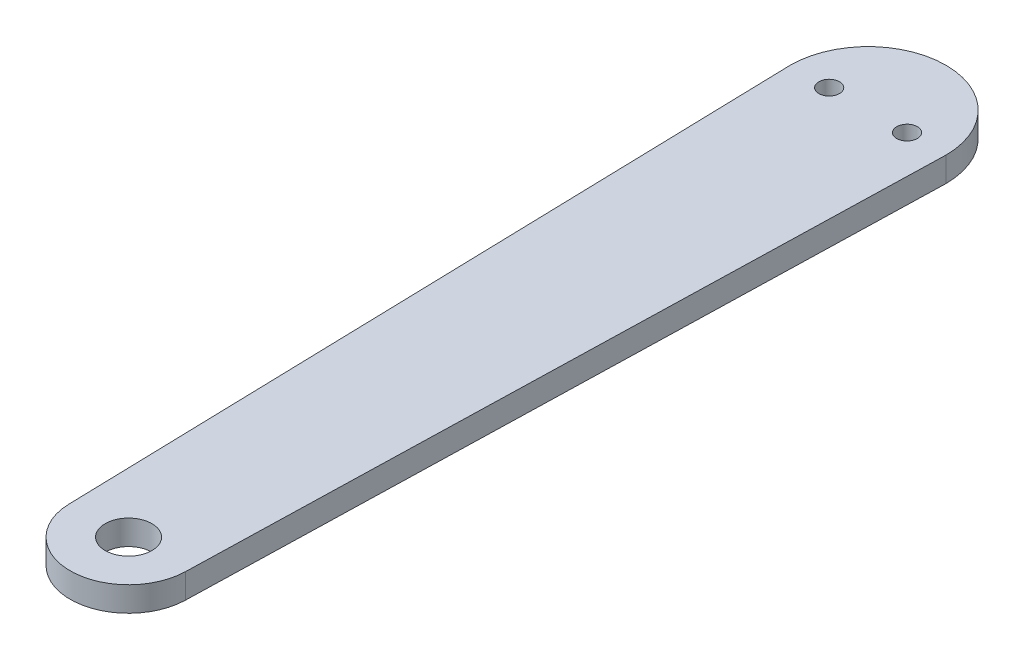
ISO-10303-21;
HEADER;
FILE_DESCRIPTION(('STEP AP214'),'2;1');
FILE_NAME('part.step','',(''),(''),'','','');
FILE_SCHEMA(('AUTOMOTIVE_DESIGN { 1 0 10303 214 1 1 1 1 }'));
ENDSEC;
DATA;
#1=APPLICATION_CONTEXT('core data for automotive mechanical design processes');
#2=APPLICATION_PROTOCOL_DEFINITION('international standard','automotive_design',2000,#1);
#3=PRODUCT_CONTEXT('',#1,'mechanical');
#4=PRODUCT('Part','Part','',(#3));
#5=PRODUCT_RELATED_PRODUCT_CATEGORY('part','',(#4));
#6=PRODUCT_DEFINITION_FORMATION('','',#4);
#7=PRODUCT_DEFINITION_CONTEXT('part definition',#1,'design');
#8=PRODUCT_DEFINITION('design','',#6,#7);
#9=PRODUCT_DEFINITION_SHAPE('','',#8);
#10=(LENGTH_UNIT() NAMED_UNIT(*) SI_UNIT(.MILLI.,.METRE.));
#11=(NAMED_UNIT(*) PLANE_ANGLE_UNIT() SI_UNIT($,.RADIAN.));
#12=(NAMED_UNIT(*) SI_UNIT($,.STERADIAN.) SOLID_ANGLE_UNIT());
#13=UNCERTAINTY_MEASURE_WITH_UNIT(LENGTH_MEASURE(1.E-05),#10,'distance_accuracy_value','');
#14=(GEOMETRIC_REPRESENTATION_CONTEXT(3) GLOBAL_UNCERTAINTY_ASSIGNED_CONTEXT((#13)) GLOBAL_UNIT_ASSIGNED_CONTEXT((#10,
#11,#12)) REPRESENTATION_CONTEXT('',''));
#15=CARTESIAN_POINT('',(0.,0.,0.));
#16=DIRECTION('',(0.,0.,1.));
#17=DIRECTION('',(1.,0.,0.));
#18=AXIS2_PLACEMENT_3D('',#15,#16,#17);
#19=CARTESIAN_POINT('',(0.,6.35,0.));
#20=DIRECTION('',(0.,-1.,0.));
#21=DIRECTION('',(0.,0.,-1.));
#22=AXIS2_PLACEMENT_3D('',#19,#20,#21);
#23=PLANE('',#22);
#24=CARTESIAN_POINT('',(-10.,6.35,0.));
#25=DIRECTION('',(0.,1.,0.));
#26=DIRECTION('',(0.,0.,1.));
#27=AXIS2_PLACEMENT_3D('',#24,#25,#26);
#28=CIRCLE('',#27,2.64999999999999);
#29=CARTESIAN_POINT('',(-10.,6.35,2.64999999999999));
#30=VERTEX_POINT('',#29);
#31=EDGE_CURVE('E130',#30,#30,#28,.T.);
#32=ORIENTED_EDGE('',*,*,#31,.F.);
#33=EDGE_LOOP('',(#32));
#34=FACE_BOUND('',#33,.T.);
#35=CARTESIAN_POINT('',(10.,6.35,0.));
#36=DIRECTION('',(0.,1.,0.));
#37=DIRECTION('',(0.,0.,1.));
#38=AXIS2_PLACEMENT_3D('',#35,#36,#37);
#39=CIRCLE('',#38,2.64999999999999);
#40=CARTESIAN_POINT('',(10.,6.35,2.64999999999999));
#41=VERTEX_POINT('',#40);
#42=EDGE_CURVE('E124',#41,#41,#39,.T.);
#43=ORIENTED_EDGE('',*,*,#42,.F.);
#44=EDGE_LOOP('',(#43));
#45=FACE_BOUND('',#44,.T.);
#46=CARTESIAN_POINT('',(0.,6.35,0.));
#47=DIRECTION('',(0.,1.,0.));
#48=DIRECTION('',(0.,0.,-1.));
#49=AXIS2_PLACEMENT_3D('',#46,#47,#48);
#50=CIRCLE('',#49,20.);
#51=CARTESIAN_POINT('',(20.,6.35,0.));
#52=VERTEX_POINT('',#51);
#53=CARTESIAN_POINT('',(-20.,6.35,0.));
#54=VERTEX_POINT('',#53);
#55=EDGE_CURVE('E89',#52,#54,#50,.T.);
#56=ORIENTED_EDGE('',*,*,#55,.T.);
#57=DIRECTION('',(0.0262794353684428,0.,0.999654636000212));
#58=VECTOR('',#57,1.);
#59=CARTESIAN_POINT('',(-20.,6.35,0.));
#60=LINE('',#59,#58);
#61=CARTESIAN_POINT('',(-14.9948195400033,6.35,190.394191530527));
#62=VERTEX_POINT('',#61);
#63=EDGE_CURVE('E84',#54,#62,#60,.T.);
#64=ORIENTED_EDGE('',*,*,#63,.T.);
#65=CARTESIAN_POINT('',(0.,6.35,190.));
#66=DIRECTION('',(0.,1.,0.));
#67=DIRECTION('',(0.,0.,1.));
#68=AXIS2_PLACEMENT_3D('',#65,#66,#67);
#69=CIRCLE('',#68,15.);
#70=CARTESIAN_POINT('',(14.9948195400031,6.35,190.394191530527));
#71=VERTEX_POINT('',#70);
#72=EDGE_CURVE('E87',#62,#71,#69,.T.);
#73=ORIENTED_EDGE('',*,*,#72,.T.);
#74=DIRECTION('',(0.0262794353684434,0.,-0.999654636000212));
#75=VECTOR('',#74,1.);
#76=CARTESIAN_POINT('',(20.,6.35,0.));
#77=LINE('',#76,#75);
#78=EDGE_CURVE('E54',#71,#52,#77,.T.);
#79=ORIENTED_EDGE('',*,*,#78,.T.);
#80=EDGE_LOOP('',(#56,#64,#73,#79));
#81=FACE_BOUND('',#80,.T.);
#82=CARTESIAN_POINT('',(0.,6.35,190.));
#83=DIRECTION('',(0.,1.,0.));
#84=DIRECTION('',(0.,0.,1.));
#85=AXIS2_PLACEMENT_3D('',#82,#83,#84);
#86=CIRCLE('',#85,6.00000000000001);
#87=CARTESIAN_POINT('',(0.,6.35,196.));
#88=VERTEX_POINT('',#87);
#89=EDGE_CURVE('E104',#88,#88,#86,.T.);
#90=ORIENTED_EDGE('',*,*,#89,.F.);
#91=EDGE_LOOP('',(#90));
#92=FACE_BOUND('',#91,.T.);
#93=ADVANCED_FACE('F37',(#34,#45,#81,#92),#23,.F.);
#94=CARTESIAN_POINT('',(0.,0.,0.));
#95=DIRECTION('',(0.,-1.,0.));
#96=DIRECTION('',(0.,0.,-1.));
#97=AXIS2_PLACEMENT_3D('',#94,#95,#96);
#98=PLANE('',#97);
#99=CARTESIAN_POINT('',(-10.,0.,0.));
#100=DIRECTION('',(0.,1.,0.));
#101=DIRECTION('',(0.,0.,1.));
#102=AXIS2_PLACEMENT_3D('',#99,#100,#101);
#103=CIRCLE('',#102,2.65);
#104=CARTESIAN_POINT('',(-10.,0.,2.65));
#105=VERTEX_POINT('',#104);
#106=EDGE_CURVE('E127',#105,#105,#103,.T.);
#107=ORIENTED_EDGE('',*,*,#106,.T.);
#108=EDGE_LOOP('',(#107));
#109=FACE_BOUND('',#108,.T.);
#110=CARTESIAN_POINT('',(10.,0.,0.));
#111=DIRECTION('',(0.,1.,0.));
#112=DIRECTION('',(0.,0.,1.));
#113=AXIS2_PLACEMENT_3D('',#110,#111,#112);
#114=CIRCLE('',#113,2.65);
#115=CARTESIAN_POINT('',(10.,0.,2.65));
#116=VERTEX_POINT('',#115);
#117=EDGE_CURVE('E119',#116,#116,#114,.T.);
#118=ORIENTED_EDGE('',*,*,#117,.T.);
#119=EDGE_LOOP('',(#118));
#120=FACE_BOUND('',#119,.T.);
#121=CARTESIAN_POINT('',(0.,0.,0.));
#122=DIRECTION('',(0.,1.,0.));
#123=DIRECTION('',(0.,0.,-1.));
#124=AXIS2_PLACEMENT_3D('',#121,#122,#123);
#125=CIRCLE('',#124,20.);
#126=CARTESIAN_POINT('',(20.,0.,0.));
#127=VERTEX_POINT('',#126);
#128=CARTESIAN_POINT('',(-20.,0.,0.));
#129=VERTEX_POINT('',#128);
#130=EDGE_CURVE('E101',#127,#129,#125,.T.);
#131=ORIENTED_EDGE('',*,*,#130,.F.);
#132=DIRECTION('',(0.0262794353684434,0.,-0.999654636000212));
#133=VECTOR('',#132,1.);
#134=CARTESIAN_POINT('',(20.,0.,0.));
#135=LINE('',#134,#133);
#136=CARTESIAN_POINT('',(14.9948195400031,0.,190.394191530527));
#137=VERTEX_POINT('',#136);
#138=EDGE_CURVE('E77',#137,#127,#135,.T.);
#139=ORIENTED_EDGE('',*,*,#138,.F.);
#140=CARTESIAN_POINT('',(0.,0.,190.));
#141=DIRECTION('',(0.,1.,0.));
#142=DIRECTION('',(0.,0.,1.));
#143=AXIS2_PLACEMENT_3D('',#140,#141,#142);
#144=CIRCLE('',#143,15.);
#145=CARTESIAN_POINT('',(-14.9948195400033,0.,190.394191530527));
#146=VERTEX_POINT('',#145);
#147=EDGE_CURVE('E71',#146,#137,#144,.T.);
#148=ORIENTED_EDGE('',*,*,#147,.F.);
#149=DIRECTION('',(0.0262794353684428,0.,0.999654636000212));
#150=VECTOR('',#149,1.);
#151=CARTESIAN_POINT('',(-20.,0.,0.));
#152=LINE('',#151,#150);
#153=EDGE_CURVE('E93',#129,#146,#152,.T.);
#154=ORIENTED_EDGE('',*,*,#153,.F.);
#155=EDGE_LOOP('',(#131,#139,#148,#154));
#156=FACE_BOUND('',#155,.T.);
#157=CARTESIAN_POINT('',(0.,0.,190.));
#158=DIRECTION('',(0.,1.,0.));
#159=DIRECTION('',(0.,0.,1.));
#160=AXIS2_PLACEMENT_3D('',#157,#158,#159);
#161=CIRCLE('',#160,6.00000000000001);
#162=CARTESIAN_POINT('',(0.,0.,196.));
#163=VERTEX_POINT('',#162);
#164=EDGE_CURVE('E116',#163,#163,#161,.T.);
#165=ORIENTED_EDGE('',*,*,#164,.T.);
#166=EDGE_LOOP('',(#165));
#167=FACE_BOUND('',#166,.T.);
#168=ADVANCED_FACE('F112',(#109,#120,#156,#167),#98,.T.);
#169=CARTESIAN_POINT('',(0.,6.35,0.));
#170=DIRECTION('',(0.,-1.,0.));
#171=DIRECTION('',(0.,0.,-1.));
#172=AXIS2_PLACEMENT_3D('',#169,#170,#171);
#173=CYLINDRICAL_SURFACE('',#172,20.);
#174=ORIENTED_EDGE('',*,*,#130,.T.);
#175=DIRECTION('',(0.,-1.,0.));
#176=VECTOR('',#175,1.);
#177=CARTESIAN_POINT('',(-20.,6.35,0.));
#178=LINE('',#177,#176);
#179=EDGE_CURVE('E11',#54,#129,#178,.T.);
#180=ORIENTED_EDGE('',*,*,#179,.F.);
#181=ORIENTED_EDGE('',*,*,#55,.F.);
#182=DIRECTION('',(0.,-1.,0.));
#183=VECTOR('',#182,1.);
#184=CARTESIAN_POINT('',(20.,6.35,0.));
#185=LINE('',#184,#183);
#186=EDGE_CURVE('E97',#52,#127,#185,.T.);
#187=ORIENTED_EDGE('',*,*,#186,.T.);
#188=EDGE_LOOP('',(#174,#180,#181,#187));
#189=FACE_BOUND('',#188,.T.);
#190=ADVANCED_FACE('F39',(#189),#173,.T.);
#191=CARTESIAN_POINT('',(-20.,6.35,0.));
#192=DIRECTION('',(0.999654636000212,0.,-0.0262794353684428));
#193=DIRECTION('',(-0.0262794353684428,0.,-0.999654636000212));
#194=AXIS2_PLACEMENT_3D('',#191,#192,#193);
#195=PLANE('',#194);
#196=ORIENTED_EDGE('',*,*,#153,.T.);
#197=DIRECTION('',(0.,-1.,0.));
#198=VECTOR('',#197,1.);
#199=CARTESIAN_POINT('',(-14.9948195400033,6.35,190.394191530527));
#200=LINE('',#199,#198);
#201=EDGE_CURVE('E46',#62,#146,#200,.T.);
#202=ORIENTED_EDGE('',*,*,#201,.F.);
#203=ORIENTED_EDGE('',*,*,#63,.F.);
#204=ORIENTED_EDGE('',*,*,#179,.T.);
#205=EDGE_LOOP('',(#196,#202,#203,#204));
#206=FACE_BOUND('',#205,.T.);
#207=ADVANCED_FACE('F92',(#206),#195,.F.);
#208=CARTESIAN_POINT('',(0.,6.35,190.));
#209=DIRECTION('',(0.,-1.,0.));
#210=DIRECTION('',(0.,0.,-1.));
#211=AXIS2_PLACEMENT_3D('',#208,#209,#210);
#212=CYLINDRICAL_SURFACE('',#211,15.);
#213=ORIENTED_EDGE('',*,*,#147,.T.);
#214=DIRECTION('',(0.,-1.,0.));
#215=VECTOR('',#214,1.);
#216=CARTESIAN_POINT('',(14.9948195400031,6.35,190.394191530527));
#217=LINE('',#216,#215);
#218=EDGE_CURVE('E94',#71,#137,#217,.T.);
#219=ORIENTED_EDGE('',*,*,#218,.F.);
#220=ORIENTED_EDGE('',*,*,#72,.F.);
#221=ORIENTED_EDGE('',*,*,#201,.T.);
#222=EDGE_LOOP('',(#213,#219,#220,#221));
#223=FACE_BOUND('',#222,.T.);
#224=ADVANCED_FACE('F95',(#223),#212,.T.);
#225=CARTESIAN_POINT('',(20.,6.35,0.));
#226=DIRECTION('',(-0.999654636000212,0.,-0.0262794353684434));
#227=DIRECTION('',(-0.0262794353684434,0.,0.999654636000212));
#228=AXIS2_PLACEMENT_3D('',#225,#226,#227);
#229=PLANE('',#228);
#230=ORIENTED_EDGE('',*,*,#138,.T.);
#231=ORIENTED_EDGE('',*,*,#186,.F.);
#232=ORIENTED_EDGE('',*,*,#78,.F.);
#233=ORIENTED_EDGE('',*,*,#218,.T.);
#234=EDGE_LOOP('',(#230,#231,#232,#233));
#235=FACE_BOUND('',#234,.T.);
#236=ADVANCED_FACE('F109',(#235),#229,.F.);
#237=CARTESIAN_POINT('',(0.,6.35,190.));
#238=DIRECTION('',(0.,-1.,0.));
#239=DIRECTION('',(0.,0.,-1.));
#240=AXIS2_PLACEMENT_3D('',#237,#238,#239);
#241=CYLINDRICAL_SURFACE('',#240,6.00000000000001);
#242=ORIENTED_EDGE('',*,*,#89,.T.);
#243=EDGE_LOOP('',(#242));
#244=FACE_BOUND('',#243,.T.);
#245=ORIENTED_EDGE('',*,*,#164,.F.);
#246=EDGE_LOOP('',(#245));
#247=FACE_BOUND('',#246,.T.);
#248=ADVANCED_FACE('F143',(#244,#247),#241,.F.);
#249=CARTESIAN_POINT('',(10.,6.35,0.));
#250=DIRECTION('',(0.,1.,0.));
#251=DIRECTION('',(0.,0.,1.));
#252=AXIS2_PLACEMENT_3D('',#249,#250,#251);
#253=CYLINDRICAL_SURFACE('',#252,2.64999999999999);
#254=ORIENTED_EDGE('',*,*,#117,.F.);
#255=EDGE_LOOP('',(#254));
#256=FACE_BOUND('',#255,.T.);
#257=ORIENTED_EDGE('',*,*,#42,.T.);
#258=EDGE_LOOP('',(#257));
#259=FACE_BOUND('',#258,.T.);
#260=ADVANCED_FACE('F141',(#256,#259),#253,.F.);
#261=CARTESIAN_POINT('',(-10.,6.35,0.));
#262=DIRECTION('',(0.,1.,0.));
#263=DIRECTION('',(0.,0.,1.));
#264=AXIS2_PLACEMENT_3D('',#261,#262,#263);
#265=CYLINDRICAL_SURFACE('',#264,2.64999999999999);
#266=ORIENTED_EDGE('',*,*,#106,.F.);
#267=EDGE_LOOP('',(#266));
#268=FACE_BOUND('',#267,.T.);
#269=ORIENTED_EDGE('',*,*,#31,.T.);
#270=EDGE_LOOP('',(#269));
#271=FACE_BOUND('',#270,.T.);
#272=ADVANCED_FACE('F134',(#268,#271),#265,.F.);
#273=CLOSED_SHELL('',(#93,#168,#190,#207,#224,#236,#248,#260,#272));
#274=MANIFOLD_SOLID_BREP('B2',#273);
#275=ADVANCED_BREP_SHAPE_REPRESENTATION('',(#18,#274),#14);
#276=SHAPE_DEFINITION_REPRESENTATION(#9,#275);
ENDSEC;
END-ISO-10303-21;
